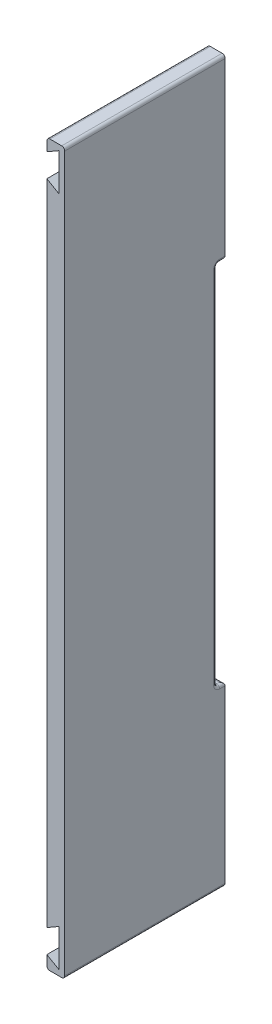
ISO-10303-21;
HEADER;
FILE_DESCRIPTION(('STEP AP214'),'2;1');
FILE_NAME('part.step','',(''),(''),'','','');
FILE_SCHEMA(('AUTOMOTIVE_DESIGN { 1 0 10303 214 1 1 1 1 }'));
ENDSEC;
DATA;
#1=APPLICATION_CONTEXT('core data for automotive mechanical design processes');
#2=APPLICATION_PROTOCOL_DEFINITION('international standard','automotive_design',2000,#1);
#3=PRODUCT_CONTEXT('',#1,'mechanical');
#4=PRODUCT('Part','Part','',(#3));
#5=PRODUCT_RELATED_PRODUCT_CATEGORY('part','',(#4));
#6=PRODUCT_DEFINITION_FORMATION('','',#4);
#7=PRODUCT_DEFINITION_CONTEXT('part definition',#1,'design');
#8=PRODUCT_DEFINITION('design','',#6,#7);
#9=PRODUCT_DEFINITION_SHAPE('','',#8);
#10=(LENGTH_UNIT() NAMED_UNIT(*) SI_UNIT(.MILLI.,.METRE.));
#11=(NAMED_UNIT(*) PLANE_ANGLE_UNIT() SI_UNIT($,.RADIAN.));
#12=(NAMED_UNIT(*) SI_UNIT($,.STERADIAN.) SOLID_ANGLE_UNIT());
#13=UNCERTAINTY_MEASURE_WITH_UNIT(LENGTH_MEASURE(1.E-05),#10,'distance_accuracy_value','');
#14=(GEOMETRIC_REPRESENTATION_CONTEXT(3) GLOBAL_UNCERTAINTY_ASSIGNED_CONTEXT((#13)) GLOBAL_UNIT_ASSIGNED_CONTEXT((#10,
#11,#12)) REPRESENTATION_CONTEXT('',''));
#15=CARTESIAN_POINT('',(0.,0.,0.));
#16=DIRECTION('',(0.,0.,1.));
#17=DIRECTION('',(1.,0.,0.));
#18=AXIS2_PLACEMENT_3D('',#15,#16,#17);
#19=CARTESIAN_POINT('',(0.,-226.14,53.));
#20=DIRECTION('',(1.,0.,0.));
#21=DIRECTION('',(0.,1.,0.));
#22=AXIS2_PLACEMENT_3D('',#19,#20,#21);
#23=PLANE('',#22);
#24=DIRECTION('',(0.,-1.,0.));
#25=VECTOR('',#24,1.);
#26=CARTESIAN_POINT('',(0.,-226.14,0.));
#27=LINE('',#26,#25);
#28=CARTESIAN_POINT('',(0.,-11.86,0.));
#29=VERTEX_POINT('',#28);
#30=CARTESIAN_POINT('',(6.1431709465119E-13,-57.5000000000001,0.));
#31=VERTEX_POINT('',#30);
#32=EDGE_CURVE('E282',#29,#31,#27,.T.);
#33=ORIENTED_EDGE('',*,*,#32,.T.);
#34=DIRECTION('',(0.,0.,1.));
#35=VECTOR('',#34,1.);
#36=CARTESIAN_POINT('',(6.14308950930287E-13,-57.5,2.8));
#37=LINE('',#36,#35);
#38=CARTESIAN_POINT('',(6.14317094651191E-13,-57.5,1.79999999999999));
#39=VERTEX_POINT('',#38);
#40=EDGE_CURVE('E349',#31,#39,#37,.T.);
#41=ORIENTED_EDGE('',*,*,#40,.T.);
#42=CARTESIAN_POINT('',(6.07153216591882E-13,-59.5,1.79999999999999));
#43=DIRECTION('',(1.,0.,0.));
#44=DIRECTION('',(0.,1.,0.));
#45=AXIS2_PLACEMENT_3D('',#42,#43,#44);
#46=CIRCLE('',#45,2.);
#47=CARTESIAN_POINT('',(6.07038405593292E-13,-59.5,3.79999999999999));
#48=VERTEX_POINT('',#47);
#49=EDGE_CURVE('E346',#48,#39,#46,.F.);
#50=ORIENTED_EDGE('',*,*,#49,.F.);
#51=DIRECTION('',(0.,-1.,0.));
#52=VECTOR('',#51,1.);
#53=CARTESIAN_POINT('',(1.70436581514721E-13,-179.5,3.79999999999998));
#54=LINE('',#53,#52);
#55=CARTESIAN_POINT('',(1.73956406648338E-13,-178.5,3.79999999999998));
#56=VERTEX_POINT('',#55);
#57=EDGE_CURVE('E342',#48,#56,#54,.T.);
#58=ORIENTED_EDGE('',*,*,#57,.T.);
#59=CARTESIAN_POINT('',(1.74122868901172E-13,-178.5,1.79999999999998));
#60=DIRECTION('',(1.,0.,0.));
#61=DIRECTION('',(0.,1.,0.));
#62=AXIS2_PLACEMENT_3D('',#59,#60,#61);
#63=CIRCLE('',#62,2.);
#64=CARTESIAN_POINT('',(1.66677717590439E-13,-180.5,1.79999999999998));
#65=VERTEX_POINT('',#64);
#66=EDGE_CURVE('E339',#65,#56,#63,.F.);
#67=ORIENTED_EDGE('',*,*,#66,.F.);
#68=DIRECTION('',(0.,0.,-1.));
#69=VECTOR('',#68,1.);
#70=CARTESIAN_POINT('',(1.66750294128271E-13,-180.5,0.));
#71=LINE('',#70,#69);
#72=CARTESIAN_POINT('',(1.66677717590439E-13,-180.5,0.));
#73=VERTEX_POINT('',#72);
#74=EDGE_CURVE('E344',#65,#73,#71,.T.);
#75=ORIENTED_EDGE('',*,*,#74,.T.);
#76=CARTESIAN_POINT('',(0.,-226.14,0.));
#77=VERTEX_POINT('',#76);
#78=EDGE_CURVE('E281',#73,#77,#27,.T.);
#79=ORIENTED_EDGE('',*,*,#78,.T.);
#80=DIRECTION('',(0.,0.,-1.));
#81=VECTOR('',#80,1.);
#82=CARTESIAN_POINT('',(0.,-226.14,53.));
#83=LINE('',#82,#81);
#84=CARTESIAN_POINT('',(0.,-226.14,53.));
#85=VERTEX_POINT('',#84);
#86=EDGE_CURVE('E308',#85,#77,#83,.T.);
#87=ORIENTED_EDGE('',*,*,#86,.F.);
#88=DIRECTION('',(0.,-1.,0.));
#89=VECTOR('',#88,1.);
#90=CARTESIAN_POINT('',(0.,-11.86,53.));
#91=LINE('',#90,#89);
#92=CARTESIAN_POINT('',(0.,-11.86,53.));
#93=VERTEX_POINT('',#92);
#94=EDGE_CURVE('E253',#93,#85,#91,.T.);
#95=ORIENTED_EDGE('',*,*,#94,.F.);
#96=DIRECTION('',(0.,0.,-1.));
#97=VECTOR('',#96,1.);
#98=CARTESIAN_POINT('',(0.,-11.86,53.));
#99=LINE('',#98,#97);
#100=EDGE_CURVE('E311',#93,#29,#99,.T.);
#101=ORIENTED_EDGE('',*,*,#100,.T.);
#102=EDGE_LOOP('',(#33,#41,#50,#58,#67,#75,#79,#87,#95,#101));
#103=FACE_BOUND('',#102,.T.);
#104=ADVANCED_FACE('F37',(#103),#23,.F.);
#105=CARTESIAN_POINT('',(5.9,-8.66559145378895,53.));
#106=DIRECTION('',(-1.,0.,0.));
#107=DIRECTION('',(0.,0.,1.));
#108=AXIS2_PLACEMENT_3D('',#105,#106,#107);
#109=PLANE('',#108);
#110=DIRECTION('',(0.,1.,0.));
#111=VECTOR('',#110,1.);
#112=CARTESIAN_POINT('',(5.9,-229.334408546211,53.));
#113=LINE('',#112,#111);
#114=CARTESIAN_POINT('',(5.9,-237.,53.));
#115=VERTEX_POINT('',#114);
#116=CARTESIAN_POINT('',(5.9,-1.,53.));
#117=VERTEX_POINT('',#116);
#118=EDGE_CURVE('E266',#115,#117,#113,.T.);
#119=ORIENTED_EDGE('',*,*,#118,.F.);
#120=DIRECTION('',(0.,0.,-1.));
#121=VECTOR('',#120,1.);
#122=CARTESIAN_POINT('',(5.9,-237.,53.));
#123=LINE('',#122,#121);
#124=CARTESIAN_POINT('',(5.9,-237.,0.));
#125=VERTEX_POINT('',#124);
#126=EDGE_CURVE('E438',#115,#125,#123,.T.);
#127=ORIENTED_EDGE('',*,*,#126,.T.);
#128=DIRECTION('',(0.,1.,0.));
#129=VECTOR('',#128,1.);
#130=CARTESIAN_POINT('',(5.9,-8.66559145378895,0.));
#131=LINE('',#130,#129);
#132=CARTESIAN_POINT('',(5.9,-180.5,0.));
#133=VERTEX_POINT('',#132);
#134=EDGE_CURVE('E298',#125,#133,#131,.T.);
#135=ORIENTED_EDGE('',*,*,#134,.T.);
#136=DIRECTION('',(0.,0.,-1.));
#137=VECTOR('',#136,1.);
#138=CARTESIAN_POINT('',(5.9,-180.5,2.79999999999998));
#139=LINE('',#138,#137);
#140=CARTESIAN_POINT('',(5.9,-180.5,1.79999999999998));
#141=VERTEX_POINT('',#140);
#142=EDGE_CURVE('E334',#133,#141,#139,.F.);
#143=ORIENTED_EDGE('',*,*,#142,.T.);
#144=CARTESIAN_POINT('',(5.9,-178.5,1.79999999999998));
#145=DIRECTION('',(-1.,0.,0.));
#146=DIRECTION('',(0.,0.,1.));
#147=AXIS2_PLACEMENT_3D('',#144,#145,#146);
#148=CIRCLE('',#147,2.);
#149=CARTESIAN_POINT('',(5.9,-178.5,3.79999999999998));
#150=VERTEX_POINT('',#149);
#151=EDGE_CURVE('E331',#150,#141,#148,.F.);
#152=ORIENTED_EDGE('',*,*,#151,.F.);
#153=DIRECTION('',(0.,-1.,0.));
#154=VECTOR('',#153,1.);
#155=CARTESIAN_POINT('',(5.9,-58.5,3.79999999999999));
#156=LINE('',#155,#154);
#157=CARTESIAN_POINT('',(5.9,-59.5,3.79999999999999));
#158=VERTEX_POINT('',#157);
#159=EDGE_CURVE('E329',#150,#158,#156,.F.);
#160=ORIENTED_EDGE('',*,*,#159,.T.);
#161=CARTESIAN_POINT('',(5.9,-59.5,1.79999999999999));
#162=DIRECTION('',(-1.,0.,0.));
#163=DIRECTION('',(0.,0.,1.));
#164=AXIS2_PLACEMENT_3D('',#161,#162,#163);
#165=CIRCLE('',#164,2.);
#166=CARTESIAN_POINT('',(5.9,-57.5,1.79999999999999));
#167=VERTEX_POINT('',#166);
#168=EDGE_CURVE('E326',#167,#158,#165,.F.);
#169=ORIENTED_EDGE('',*,*,#168,.F.);
#170=DIRECTION('',(0.,0.,1.));
#171=VECTOR('',#170,1.);
#172=CARTESIAN_POINT('',(5.9,-57.5,0.));
#173=LINE('',#172,#171);
#174=CARTESIAN_POINT('',(5.9,-57.5,0.));
#175=VERTEX_POINT('',#174);
#176=EDGE_CURVE('E336',#167,#175,#173,.F.);
#177=ORIENTED_EDGE('',*,*,#176,.T.);
#178=CARTESIAN_POINT('',(5.9,-1.,0.));
#179=VERTEX_POINT('',#178);
#180=EDGE_CURVE('E297',#175,#179,#131,.T.);
#181=ORIENTED_EDGE('',*,*,#180,.T.);
#182=DIRECTION('',(0.,0.,-1.));
#183=VECTOR('',#182,1.);
#184=CARTESIAN_POINT('',(5.9,-1.,53.));
#185=LINE('',#184,#183);
#186=EDGE_CURVE('E436',#179,#117,#185,.F.);
#187=ORIENTED_EDGE('',*,*,#186,.T.);
#188=EDGE_LOOP('',(#119,#127,#135,#143,#152,#160,#169,#177,#181,#187));
#189=FACE_BOUND('',#188,.T.);
#190=ADVANCED_FACE('F454',(#189),#109,.F.);
#191=CARTESIAN_POINT('',(0.,0.,0.));
#192=DIRECTION('',(0.,0.,1.));
#193=DIRECTION('',(1.,0.,0.));
#194=AXIS2_PLACEMENT_3D('',#191,#192,#193);
#195=PLANE('',#194);
#196=DIRECTION('',(-1.,0.,0.));
#197=VECTOR('',#196,1.);
#198=CARTESIAN_POINT('',(5.9,0.,0.));
#199=LINE('',#198,#197);
#200=CARTESIAN_POINT('',(4.9,0.,0.));
#201=VERTEX_POINT('',#200);
#202=CARTESIAN_POINT('',(1.,0.,0.));
#203=VERTEX_POINT('',#202);
#204=EDGE_CURVE('E270',#201,#203,#199,.T.);
#205=ORIENTED_EDGE('',*,*,#204,.F.);
#206=CARTESIAN_POINT('',(4.9,-1.,0.));
#207=DIRECTION('',(0.,0.,1.));
#208=DIRECTION('',(1.,0.,0.));
#209=AXIS2_PLACEMENT_3D('',#206,#207,#208);
#210=CIRCLE('',#209,1.);
#211=EDGE_CURVE('E45',#201,#179,#210,.F.);
#212=ORIENTED_EDGE('',*,*,#211,.T.);
#213=ORIENTED_EDGE('',*,*,#180,.F.);
#214=DIRECTION('',(1.,0.,0.));
#215=VECTOR('',#214,1.);
#216=CARTESIAN_POINT('',(-2.08166817117217E-13,-57.5,0.));
#217=LINE('',#216,#215);
#218=EDGE_CURVE('E360',#175,#31,#217,.F.);
#219=ORIENTED_EDGE('',*,*,#218,.T.);
#220=ORIENTED_EDGE('',*,*,#32,.F.);
#221=DIRECTION('',(-0.86602540378444,0.499999999999998,0.));
#222=VECTOR('',#221,1.);
#223=CARTESIAN_POINT('',(0.,-11.86,0.));
#224=LINE('',#223,#222);
#225=CARTESIAN_POINT('',(4.00969761952194,-14.175,0.));
#226=VERTEX_POINT('',#225);
#227=EDGE_CURVE('E278',#226,#29,#224,.T.);
#228=ORIENTED_EDGE('',*,*,#227,.F.);
#229=DIRECTION('',(0.,-1.,0.));
#230=VECTOR('',#229,1.);
#231=CARTESIAN_POINT('',(4.00969761952194,-1.82499999999998,0.));
#232=LINE('',#231,#230);
#233=CARTESIAN_POINT('',(4.00969761952194,-1.82499999999998,0.));
#234=VERTEX_POINT('',#233);
#235=EDGE_CURVE('E276',#234,#226,#232,.T.);
#236=ORIENTED_EDGE('',*,*,#235,.F.);
#237=DIRECTION('',(0.866025403784436,0.500000000000004,0.));
#238=VECTOR('',#237,1.);
#239=CARTESIAN_POINT('',(0.,-4.14,0.));
#240=LINE('',#239,#238);
#241=CARTESIAN_POINT('',(0.,-4.14,0.));
#242=VERTEX_POINT('',#241);
#243=EDGE_CURVE('E274',#242,#234,#240,.T.);
#244=ORIENTED_EDGE('',*,*,#243,.F.);
#245=DIRECTION('',(0.,-1.,0.));
#246=VECTOR('',#245,1.);
#247=CARTESIAN_POINT('',(0.,0.,0.));
#248=LINE('',#247,#246);
#249=CARTESIAN_POINT('',(0.,-1.,0.));
#250=VERTEX_POINT('',#249);
#251=EDGE_CURVE('E237',#250,#242,#248,.T.);
#252=ORIENTED_EDGE('',*,*,#251,.F.);
#253=CARTESIAN_POINT('',(1.,-1.,0.));
#254=DIRECTION('',(0.,0.,1.));
#255=DIRECTION('',(1.,0.,0.));
#256=AXIS2_PLACEMENT_3D('',#253,#254,#255);
#257=CIRCLE('',#256,1.);
#258=EDGE_CURVE('E52',#250,#203,#257,.F.);
#259=ORIENTED_EDGE('',*,*,#258,.T.);
#260=EDGE_LOOP('',(#205,#212,#213,#219,#220,#228,#236,#244,#252,#259));
#261=FACE_BOUND('',#260,.T.);
#262=ADVANCED_FACE('F448',(#261),#195,.F.);
#263=DIRECTION('',(1.,0.,0.));
#264=VECTOR('',#263,1.);
#265=CARTESIAN_POINT('',(5.9,-238.,0.));
#266=LINE('',#265,#264);
#267=CARTESIAN_POINT('',(0.999999999999996,-238.,0.));
#268=VERTEX_POINT('',#267);
#269=CARTESIAN_POINT('',(4.9,-238.,0.));
#270=VERTEX_POINT('',#269);
#271=EDGE_CURVE('E294',#268,#270,#266,.T.);
#272=ORIENTED_EDGE('',*,*,#271,.F.);
#273=CARTESIAN_POINT('',(1.,-237.,0.));
#274=DIRECTION('',(0.,0.,1.));
#275=DIRECTION('',(1.,0.,0.));
#276=AXIS2_PLACEMENT_3D('',#273,#274,#275);
#277=CIRCLE('',#276,1.);
#278=CARTESIAN_POINT('',(0.,-237.,0.));
#279=VERTEX_POINT('',#278);
#280=EDGE_CURVE('E425',#268,#279,#277,.F.);
#281=ORIENTED_EDGE('',*,*,#280,.T.);
#282=DIRECTION('',(0.,-1.,0.));
#283=VECTOR('',#282,1.);
#284=CARTESIAN_POINT('',(0.,-238.,0.));
#285=LINE('',#284,#283);
#286=CARTESIAN_POINT('',(0.,-233.86,0.));
#287=VERTEX_POINT('',#286);
#288=EDGE_CURVE('E291',#287,#279,#285,.T.);
#289=ORIENTED_EDGE('',*,*,#288,.F.);
#290=DIRECTION('',(-0.866025403784434,0.500000000000008,0.));
#291=VECTOR('',#290,1.);
#292=CARTESIAN_POINT('',(0.,-233.86,0.));
#293=LINE('',#292,#291);
#294=CARTESIAN_POINT('',(4.00969761952194,-236.175,0.));
#295=VERTEX_POINT('',#294);
#296=EDGE_CURVE('E289',#295,#287,#293,.T.);
#297=ORIENTED_EDGE('',*,*,#296,.F.);
#298=DIRECTION('',(0.,-1.,0.));
#299=VECTOR('',#298,1.);
#300=CARTESIAN_POINT('',(4.00969761952194,-236.175,0.));
#301=LINE('',#300,#299);
#302=CARTESIAN_POINT('',(4.00969761952194,-223.825,0.));
#303=VERTEX_POINT('',#302);
#304=EDGE_CURVE('E287',#303,#295,#301,.T.);
#305=ORIENTED_EDGE('',*,*,#304,.F.);
#306=DIRECTION('',(0.866025403784439,0.499999999999998,0.));
#307=VECTOR('',#306,1.);
#308=CARTESIAN_POINT('',(0.,-226.14,0.));
#309=LINE('',#308,#307);
#310=EDGE_CURVE('E285',#77,#303,#309,.T.);
#311=ORIENTED_EDGE('',*,*,#310,.F.);
#312=ORIENTED_EDGE('',*,*,#78,.F.);
#313=DIRECTION('',(-1.,0.,0.));
#314=VECTOR('',#313,1.);
#315=CARTESIAN_POINT('',(5.9,-180.5,0.));
#316=LINE('',#315,#314);
#317=EDGE_CURVE('E371',#73,#133,#316,.F.);
#318=ORIENTED_EDGE('',*,*,#317,.T.);
#319=ORIENTED_EDGE('',*,*,#134,.F.);
#320=CARTESIAN_POINT('',(4.9,-237.,0.));
#321=DIRECTION('',(0.,0.,1.));
#322=DIRECTION('',(1.,0.,0.));
#323=AXIS2_PLACEMENT_3D('',#320,#321,#322);
#324=CIRCLE('',#323,1.);
#325=EDGE_CURVE('E423',#125,#270,#324,.F.);
#326=ORIENTED_EDGE('',*,*,#325,.T.);
#327=EDGE_LOOP('',(#272,#281,#289,#297,#305,#311,#312,#318,#319,#326));
#328=FACE_BOUND('',#327,.T.);
#329=ADVANCED_FACE('F504',(#328),#195,.F.);
#330=CARTESIAN_POINT('',(5.9,0.,53.));
#331=DIRECTION('',(0.,-1.,0.));
#332=DIRECTION('',(1.,0.,0.));
#333=AXIS2_PLACEMENT_3D('',#330,#331,#332);
#334=PLANE('',#333);
#335=DIRECTION('',(-1.,0.,0.));
#336=VECTOR('',#335,1.);
#337=CARTESIAN_POINT('',(5.9,0.,53.));
#338=LINE('',#337,#336);
#339=CARTESIAN_POINT('',(4.9,0.,53.));
#340=VERTEX_POINT('',#339);
#341=CARTESIAN_POINT('',(1.,0.,53.));
#342=VERTEX_POINT('',#341);
#343=EDGE_CURVE('E232',#340,#342,#338,.T.);
#344=ORIENTED_EDGE('',*,*,#343,.F.);
#345=DIRECTION('',(0.,0.,-1.));
#346=VECTOR('',#345,1.);
#347=CARTESIAN_POINT('',(4.9,0.,53.));
#348=LINE('',#347,#346);
#349=EDGE_CURVE('E443',#340,#201,#348,.T.);
#350=ORIENTED_EDGE('',*,*,#349,.T.);
#351=ORIENTED_EDGE('',*,*,#204,.T.);
#352=DIRECTION('',(0.,0.,-1.));
#353=VECTOR('',#352,1.);
#354=CARTESIAN_POINT('',(1.,0.,53.));
#355=LINE('',#354,#353);
#356=EDGE_CURVE('E441',#203,#342,#355,.F.);
#357=ORIENTED_EDGE('',*,*,#356,.T.);
#358=EDGE_LOOP('',(#344,#350,#351,#357));
#359=FACE_BOUND('',#358,.T.);
#360=ADVANCED_FACE('F460',(#359),#334,.F.);
#361=CARTESIAN_POINT('',(0.,0.,53.));
#362=DIRECTION('',(1.,0.,0.));
#363=DIRECTION('',(0.,1.,0.));
#364=AXIS2_PLACEMENT_3D('',#361,#362,#363);
#365=PLANE('',#364);
#366=DIRECTION('',(0.,-1.,0.));
#367=VECTOR('',#366,1.);
#368=CARTESIAN_POINT('',(0.,0.,53.));
#369=LINE('',#368,#367);
#370=CARTESIAN_POINT('',(0.,-1.,53.));
#371=VERTEX_POINT('',#370);
#372=CARTESIAN_POINT('',(0.,-4.14,53.));
#373=VERTEX_POINT('',#372);
#374=EDGE_CURVE('E221',#371,#373,#369,.T.);
#375=ORIENTED_EDGE('',*,*,#374,.F.);
#376=DIRECTION('',(0.,0.,-1.));
#377=VECTOR('',#376,1.);
#378=CARTESIAN_POINT('',(0.,-1.,53.));
#379=LINE('',#378,#377);
#380=EDGE_CURVE('E11',#371,#250,#379,.T.);
#381=ORIENTED_EDGE('',*,*,#380,.T.);
#382=ORIENTED_EDGE('',*,*,#251,.T.);
#383=DIRECTION('',(0.,0.,-1.));
#384=VECTOR('',#383,1.);
#385=CARTESIAN_POINT('',(0.,-4.14,53.));
#386=LINE('',#385,#384);
#387=EDGE_CURVE('E235',#373,#242,#386,.T.);
#388=ORIENTED_EDGE('',*,*,#387,.F.);
#389=EDGE_LOOP('',(#375,#381,#382,#388));
#390=FACE_BOUND('',#389,.T.);
#391=ADVANCED_FACE('F236',(#390),#365,.F.);
#392=CARTESIAN_POINT('',(0.,-4.14,53.));
#393=DIRECTION('',(-0.500000000000004,0.866025403784436,0.));
#394=DIRECTION('',(-0.866025403784436,-0.500000000000004,0.));
#395=AXIS2_PLACEMENT_3D('',#392,#393,#394);
#396=PLANE('',#395);
#397=ORIENTED_EDGE('',*,*,#243,.T.);
#398=DIRECTION('',(0.,0.,-1.));
#399=VECTOR('',#398,1.);
#400=CARTESIAN_POINT('',(4.00969761952194,-1.82499999999998,53.));
#401=LINE('',#400,#399);
#402=CARTESIAN_POINT('',(4.00969761952194,-1.82499999999998,53.));
#403=VERTEX_POINT('',#402);
#404=EDGE_CURVE('E241',#403,#234,#401,.T.);
#405=ORIENTED_EDGE('',*,*,#404,.F.);
#406=DIRECTION('',(0.866025403784436,0.500000000000004,0.));
#407=VECTOR('',#406,1.);
#408=CARTESIAN_POINT('',(0.,-4.14,53.));
#409=LINE('',#408,#407);
#410=EDGE_CURVE('E226',#373,#403,#409,.T.);
#411=ORIENTED_EDGE('',*,*,#410,.F.);
#412=ORIENTED_EDGE('',*,*,#387,.T.);
#413=EDGE_LOOP('',(#397,#405,#411,#412));
#414=FACE_BOUND('',#413,.T.);
#415=ADVANCED_FACE('F243',(#414),#396,.F.);
#416=CARTESIAN_POINT('',(4.00969761952194,-1.82499999999998,53.));
#417=DIRECTION('',(1.,0.,0.));
#418=DIRECTION('',(0.,1.,0.));
#419=AXIS2_PLACEMENT_3D('',#416,#417,#418);
#420=PLANE('',#419);
#421=ORIENTED_EDGE('',*,*,#235,.T.);
#422=DIRECTION('',(0.,0.,-1.));
#423=VECTOR('',#422,1.);
#424=CARTESIAN_POINT('',(4.00969761952194,-14.175,53.));
#425=LINE('',#424,#423);
#426=CARTESIAN_POINT('',(4.00969761952194,-14.175,53.));
#427=VERTEX_POINT('',#426);
#428=EDGE_CURVE('E314',#427,#226,#425,.T.);
#429=ORIENTED_EDGE('',*,*,#428,.F.);
#430=DIRECTION('',(0.,-1.,0.));
#431=VECTOR('',#430,1.);
#432=CARTESIAN_POINT('',(4.00969761952194,-1.82499999999998,53.));
#433=LINE('',#432,#431);
#434=EDGE_CURVE('E246',#403,#427,#433,.T.);
#435=ORIENTED_EDGE('',*,*,#434,.F.);
#436=ORIENTED_EDGE('',*,*,#404,.T.);
#437=EDGE_LOOP('',(#421,#429,#435,#436));
#438=FACE_BOUND('',#437,.T.);
#439=ADVANCED_FACE('F464',(#438),#420,.F.);
#440=CARTESIAN_POINT('',(0.,-11.86,53.));
#441=DIRECTION('',(-0.499999999999998,-0.86602540378444,0.));
#442=DIRECTION('',(0.86602540378444,-0.499999999999998,0.));
#443=AXIS2_PLACEMENT_3D('',#440,#441,#442);
#444=PLANE('',#443);
#445=ORIENTED_EDGE('',*,*,#227,.T.);
#446=ORIENTED_EDGE('',*,*,#100,.F.);
#447=DIRECTION('',(-0.86602540378444,0.499999999999998,0.));
#448=VECTOR('',#447,1.);
#449=CARTESIAN_POINT('',(0.,-11.86,53.));
#450=LINE('',#449,#448);
#451=EDGE_CURVE('E248',#427,#93,#450,.T.);
#452=ORIENTED_EDGE('',*,*,#451,.F.);
#453=ORIENTED_EDGE('',*,*,#428,.T.);
#454=EDGE_LOOP('',(#445,#446,#452,#453));
#455=FACE_BOUND('',#454,.T.);
#456=ADVANCED_FACE('F471',(#455),#444,.F.);
#457=CARTESIAN_POINT('',(0.,-226.14,53.));
#458=DIRECTION('',(-0.499999999999999,0.86602540378444,0.));
#459=DIRECTION('',(-0.86602540378444,-0.499999999999999,0.));
#460=AXIS2_PLACEMENT_3D('',#457,#458,#459);
#461=PLANE('',#460);
#462=ORIENTED_EDGE('',*,*,#310,.T.);
#463=DIRECTION('',(0.,0.,-1.));
#464=VECTOR('',#463,1.);
#465=CARTESIAN_POINT('',(4.00969761952194,-223.825,53.));
#466=LINE('',#465,#464);
#467=CARTESIAN_POINT('',(4.00969761952194,-223.825,53.));
#468=VERTEX_POINT('',#467);
#469=EDGE_CURVE('E305',#468,#303,#466,.T.);
#470=ORIENTED_EDGE('',*,*,#469,.F.);
#471=DIRECTION('',(0.866025403784439,0.499999999999998,0.));
#472=VECTOR('',#471,1.);
#473=CARTESIAN_POINT('',(0.,-226.14,53.));
#474=LINE('',#473,#472);
#475=EDGE_CURVE('E255',#85,#468,#474,.T.);
#476=ORIENTED_EDGE('',*,*,#475,.F.);
#477=ORIENTED_EDGE('',*,*,#86,.T.);
#478=EDGE_LOOP('',(#462,#470,#476,#477));
#479=FACE_BOUND('',#478,.T.);
#480=ADVANCED_FACE('F478',(#479),#461,.F.);
#481=CARTESIAN_POINT('',(4.00969761952194,-236.175,53.));
#482=DIRECTION('',(1.,0.,0.));
#483=DIRECTION('',(0.,1.,0.));
#484=AXIS2_PLACEMENT_3D('',#481,#482,#483);
#485=PLANE('',#484);
#486=ORIENTED_EDGE('',*,*,#304,.T.);
#487=DIRECTION('',(0.,0.,-1.));
#488=VECTOR('',#487,1.);
#489=CARTESIAN_POINT('',(4.00969761952194,-236.175,53.));
#490=LINE('',#489,#488);
#491=CARTESIAN_POINT('',(4.00969761952194,-236.175,53.));
#492=VERTEX_POINT('',#491);
#493=EDGE_CURVE('E302',#492,#295,#490,.T.);
#494=ORIENTED_EDGE('',*,*,#493,.F.);
#495=DIRECTION('',(0.,-1.,0.));
#496=VECTOR('',#495,1.);
#497=CARTESIAN_POINT('',(4.00969761952194,-236.175,53.));
#498=LINE('',#497,#496);
#499=EDGE_CURVE('E257',#468,#492,#498,.T.);
#500=ORIENTED_EDGE('',*,*,#499,.F.);
#501=ORIENTED_EDGE('',*,*,#469,.T.);
#502=EDGE_LOOP('',(#486,#494,#500,#501));
#503=FACE_BOUND('',#502,.T.);
#504=ADVANCED_FACE('F484',(#503),#485,.F.);
#505=CARTESIAN_POINT('',(0.,-233.86,53.));
#506=DIRECTION('',(-0.500000000000008,-0.866025403784434,0.));
#507=DIRECTION('',(0.866025403784434,-0.500000000000008,0.));
#508=AXIS2_PLACEMENT_3D('',#505,#506,#507);
#509=PLANE('',#508);
#510=ORIENTED_EDGE('',*,*,#296,.T.);
#511=DIRECTION('',(0.,0.,-1.));
#512=VECTOR('',#511,1.);
#513=CARTESIAN_POINT('',(0.,-233.86,53.));
#514=LINE('',#513,#512);
#515=CARTESIAN_POINT('',(0.,-233.86,53.));
#516=VERTEX_POINT('',#515);
#517=EDGE_CURVE('E269',#516,#287,#514,.T.);
#518=ORIENTED_EDGE('',*,*,#517,.F.);
#519=DIRECTION('',(-0.866025403784434,0.500000000000008,0.));
#520=VECTOR('',#519,1.);
#521=CARTESIAN_POINT('',(0.,-233.86,53.));
#522=LINE('',#521,#520);
#523=EDGE_CURVE('E259',#492,#516,#522,.T.);
#524=ORIENTED_EDGE('',*,*,#523,.F.);
#525=ORIENTED_EDGE('',*,*,#493,.T.);
#526=EDGE_LOOP('',(#510,#518,#524,#525));
#527=FACE_BOUND('',#526,.T.);
#528=ADVANCED_FACE('F488',(#527),#509,.F.);
#529=CARTESIAN_POINT('',(0.,-238.,53.));
#530=DIRECTION('',(1.,0.,0.));
#531=DIRECTION('',(0.,1.,0.));
#532=AXIS2_PLACEMENT_3D('',#529,#530,#531);
#533=PLANE('',#532);
#534=ORIENTED_EDGE('',*,*,#288,.T.);
#535=DIRECTION('',(0.,0.,-1.));
#536=VECTOR('',#535,1.);
#537=CARTESIAN_POINT('',(0.,-237.,53.));
#538=LINE('',#537,#536);
#539=CARTESIAN_POINT('',(0.,-237.,53.));
#540=VERTEX_POINT('',#539);
#541=EDGE_CURVE('E427',#279,#540,#538,.F.);
#542=ORIENTED_EDGE('',*,*,#541,.T.);
#543=DIRECTION('',(0.,-1.,0.));
#544=VECTOR('',#543,1.);
#545=CARTESIAN_POINT('',(0.,-238.,53.));
#546=LINE('',#545,#544);
#547=EDGE_CURVE('E261',#516,#540,#546,.T.);
#548=ORIENTED_EDGE('',*,*,#547,.F.);
#549=ORIENTED_EDGE('',*,*,#517,.T.);
#550=EDGE_LOOP('',(#534,#542,#548,#549));
#551=FACE_BOUND('',#550,.T.);
#552=ADVANCED_FACE('F492',(#551),#533,.F.);
#553=CARTESIAN_POINT('',(5.9,-238.,53.));
#554=DIRECTION('',(0.,1.,0.));
#555=DIRECTION('',(-1.,0.,0.));
#556=AXIS2_PLACEMENT_3D('',#553,#554,#555);
#557=PLANE('',#556);
#558=DIRECTION('',(1.,0.,0.));
#559=VECTOR('',#558,1.);
#560=CARTESIAN_POINT('',(5.9,-238.,53.));
#561=LINE('',#560,#559);
#562=CARTESIAN_POINT('',(0.999999999999996,-238.,53.));
#563=VERTEX_POINT('',#562);
#564=CARTESIAN_POINT('',(4.9,-238.,53.));
#565=VERTEX_POINT('',#564);
#566=EDGE_CURVE('E263',#563,#565,#561,.T.);
#567=ORIENTED_EDGE('',*,*,#566,.F.);
#568=DIRECTION('',(0.,0.,-1.));
#569=VECTOR('',#568,1.);
#570=CARTESIAN_POINT('',(0.999999999999996,-238.,53.));
#571=LINE('',#570,#569);
#572=EDGE_CURVE('E420',#563,#268,#571,.T.);
#573=ORIENTED_EDGE('',*,*,#572,.T.);
#574=ORIENTED_EDGE('',*,*,#271,.T.);
#575=DIRECTION('',(0.,0.,-1.));
#576=VECTOR('',#575,1.);
#577=CARTESIAN_POINT('',(4.9,-238.,53.));
#578=LINE('',#577,#576);
#579=EDGE_CURVE('E374',#270,#565,#578,.F.);
#580=ORIENTED_EDGE('',*,*,#579,.T.);
#581=EDGE_LOOP('',(#567,#573,#574,#580));
#582=FACE_BOUND('',#581,.T.);
#583=ADVANCED_FACE('F501',(#582),#557,.F.);
#584=CARTESIAN_POINT('',(0.,0.,53.));
#585=DIRECTION('',(0.,0.,1.));
#586=DIRECTION('',(1.,0.,0.));
#587=AXIS2_PLACEMENT_3D('',#584,#585,#586);
#588=PLANE('',#587);
#589=ORIENTED_EDGE('',*,*,#547,.T.);
#590=CARTESIAN_POINT('',(1.,-237.,53.));
#591=DIRECTION('',(0.,0.,1.));
#592=DIRECTION('',(1.,0.,0.));
#593=AXIS2_PLACEMENT_3D('',#590,#591,#592);
#594=CIRCLE('',#593,1.);
#595=EDGE_CURVE('E434',#540,#563,#594,.T.);
#596=ORIENTED_EDGE('',*,*,#595,.T.);
#597=ORIENTED_EDGE('',*,*,#566,.T.);
#598=CARTESIAN_POINT('',(4.9,-237.,53.));
#599=DIRECTION('',(0.,0.,1.));
#600=DIRECTION('',(1.,0.,0.));
#601=AXIS2_PLACEMENT_3D('',#598,#599,#600);
#602=CIRCLE('',#601,1.);
#603=EDGE_CURVE('E432',#565,#115,#602,.T.);
#604=ORIENTED_EDGE('',*,*,#603,.T.);
#605=ORIENTED_EDGE('',*,*,#118,.T.);
#606=CARTESIAN_POINT('',(4.9,-1.,53.));
#607=DIRECTION('',(0.,0.,1.));
#608=DIRECTION('',(1.,0.,0.));
#609=AXIS2_PLACEMENT_3D('',#606,#607,#608);
#610=CIRCLE('',#609,1.);
#611=EDGE_CURVE('E430',#117,#340,#610,.T.);
#612=ORIENTED_EDGE('',*,*,#611,.T.);
#613=ORIENTED_EDGE('',*,*,#343,.T.);
#614=CARTESIAN_POINT('',(1.,-1.,53.));
#615=DIRECTION('',(0.,0.,1.));
#616=DIRECTION('',(1.,0.,0.));
#617=AXIS2_PLACEMENT_3D('',#614,#615,#616);
#618=CIRCLE('',#617,1.);
#619=EDGE_CURVE('E230',#342,#371,#618,.T.);
#620=ORIENTED_EDGE('',*,*,#619,.T.);
#621=ORIENTED_EDGE('',*,*,#374,.T.);
#622=ORIENTED_EDGE('',*,*,#410,.T.);
#623=ORIENTED_EDGE('',*,*,#434,.T.);
#624=ORIENTED_EDGE('',*,*,#451,.T.);
#625=ORIENTED_EDGE('',*,*,#94,.T.);
#626=ORIENTED_EDGE('',*,*,#475,.T.);
#627=ORIENTED_EDGE('',*,*,#499,.T.);
#628=ORIENTED_EDGE('',*,*,#523,.T.);
#629=EDGE_LOOP('',(#589,#596,#597,#604,#605,#612,#613,#620,#621,#622,#623,#624,#625,#626,#627,#628));
#630=FACE_BOUND('',#629,.T.);
#631=ADVANCED_FACE('F224',(#630),#588,.T.);
#632=CARTESIAN_POINT('',(51.9999999999998,-58.5000000000002,2.79999999999999));
#633=DIRECTION('',(0.,0.,-1.));
#634=DIRECTION('',(0.,1.,0.));
#635=AXIS2_PLACEMENT_3D('',#632,#633,#634);
#636=PLANE('',#635);
#637=DIRECTION('',(0.,-1.,0.));
#638=VECTOR('',#637,1.);
#639=CARTESIAN_POINT('',(1.00000000000061,-58.5,2.79999999999999));
#640=LINE('',#639,#638);
#641=CARTESIAN_POINT('',(1.00000000000017,-178.5,2.79999999999998));
#642=VERTEX_POINT('',#641);
#643=CARTESIAN_POINT('',(1.00000000000061,-59.5,2.79999999999999));
#644=VERTEX_POINT('',#643);
#645=EDGE_CURVE('E366',#642,#644,#640,.F.);
#646=ORIENTED_EDGE('',*,*,#645,.T.);
#647=DIRECTION('',(-1.,0.,0.));
#648=VECTOR('',#647,1.);
#649=CARTESIAN_POINT('',(5.9,-59.5,2.79999999999999));
#650=LINE('',#649,#648);
#651=CARTESIAN_POINT('',(4.9,-59.5,2.79999999999999));
#652=VERTEX_POINT('',#651);
#653=EDGE_CURVE('E368',#644,#652,#650,.F.);
#654=ORIENTED_EDGE('',*,*,#653,.T.);
#655=DIRECTION('',(0.,-1.,0.));
#656=VECTOR('',#655,1.);
#657=CARTESIAN_POINT('',(4.9,-179.5,2.79999999999998));
#658=LINE('',#657,#656);
#659=CARTESIAN_POINT('',(4.9,-178.5,2.79999999999998));
#660=VERTEX_POINT('',#659);
#661=EDGE_CURVE('E364',#652,#660,#658,.T.);
#662=ORIENTED_EDGE('',*,*,#661,.T.);
#663=DIRECTION('',(-1.,0.,0.));
#664=VECTOR('',#663,1.);
#665=CARTESIAN_POINT('',(-6.45317133063372E-13,-178.5,2.79999999999998));
#666=LINE('',#665,#664);
#667=EDGE_CURVE('E362',#660,#642,#666,.T.);
#668=ORIENTED_EDGE('',*,*,#667,.T.);
#669=EDGE_LOOP('',(#646,#654,#662,#668));
#670=FACE_BOUND('',#669,.T.);
#671=ADVANCED_FACE('F573',(#670),#636,.T.);
#672=CARTESIAN_POINT('',(51.9999999999998,-58.5000000000002,0.));
#673=DIRECTION('',(0.,-1.,0.));
#674=DIRECTION('',(1.,0.,0.));
#675=AXIS2_PLACEMENT_3D('',#672,#673,#674);
#676=PLANE('',#675);
#677=DIRECTION('',(0.,0.,1.));
#678=VECTOR('',#677,1.);
#679=CARTESIAN_POINT('',(1.00000000000061,-58.5,0.));
#680=LINE('',#679,#678);
#681=CARTESIAN_POINT('',(1.00000000000061,-58.5,1.79999999999999));
#682=VERTEX_POINT('',#681);
#683=CARTESIAN_POINT('',(1.00000000000061,-58.5,1.));
#684=VERTEX_POINT('',#683);
#685=EDGE_CURVE('E319',#682,#684,#680,.F.);
#686=ORIENTED_EDGE('',*,*,#685,.T.);
#687=DIRECTION('',(1.,0.,0.));
#688=VECTOR('',#687,1.);
#689=CARTESIAN_POINT('',(5.90000000000001,-58.5,1.));
#690=LINE('',#689,#688);
#691=CARTESIAN_POINT('',(4.9,-58.5,1.));
#692=VERTEX_POINT('',#691);
#693=EDGE_CURVE('E324',#684,#692,#690,.T.);
#694=ORIENTED_EDGE('',*,*,#693,.T.);
#695=DIRECTION('',(0.,0.,1.));
#696=VECTOR('',#695,1.);
#697=CARTESIAN_POINT('',(4.9,-58.5,2.79999999999999));
#698=LINE('',#697,#696);
#699=CARTESIAN_POINT('',(4.9,-58.5,1.79999999999999));
#700=VERTEX_POINT('',#699);
#701=EDGE_CURVE('E321',#692,#700,#698,.T.);
#702=ORIENTED_EDGE('',*,*,#701,.T.);
#703=DIRECTION('',(-1.,0.,0.));
#704=VECTOR('',#703,1.);
#705=CARTESIAN_POINT('',(-2.18405260396082E-13,-58.5,1.79999999999999));
#706=LINE('',#705,#704);
#707=EDGE_CURVE('E240',#700,#682,#706,.T.);
#708=ORIENTED_EDGE('',*,*,#707,.T.);
#709=EDGE_LOOP('',(#686,#694,#702,#708));
#710=FACE_BOUND('',#709,.T.);
#711=ADVANCED_FACE('F577',(#710),#676,.T.);
#712=CARTESIAN_POINT('',(51.9999999999993,-179.5,2.79999999999998));
#713=DIRECTION('',(0.,1.,0.));
#714=DIRECTION('',(-1.,0.,0.));
#715=AXIS2_PLACEMENT_3D('',#712,#713,#714);
#716=PLANE('',#715);
#717=DIRECTION('',(0.,0.,-1.));
#718=VECTOR('',#717,1.);
#719=CARTESIAN_POINT('',(1.00000000000017,-179.5,2.79999999999998));
#720=LINE('',#719,#718);
#721=CARTESIAN_POINT('',(1.00000000000017,-179.5,1.));
#722=VERTEX_POINT('',#721);
#723=CARTESIAN_POINT('',(1.00000000000017,-179.5,1.79999999999998));
#724=VERTEX_POINT('',#723);
#725=EDGE_CURVE('E355',#722,#724,#720,.F.);
#726=ORIENTED_EDGE('',*,*,#725,.T.);
#727=DIRECTION('',(-1.,0.,0.));
#728=VECTOR('',#727,1.);
#729=CARTESIAN_POINT('',(5.90000000000001,-179.5,1.79999999999998));
#730=LINE('',#729,#728);
#731=CARTESIAN_POINT('',(4.9,-179.5,1.79999999999998));
#732=VERTEX_POINT('',#731);
#733=EDGE_CURVE('E358',#724,#732,#730,.F.);
#734=ORIENTED_EDGE('',*,*,#733,.T.);
#735=DIRECTION('',(0.,0.,-1.));
#736=VECTOR('',#735,1.);
#737=CARTESIAN_POINT('',(4.9,-179.5,0.));
#738=LINE('',#737,#736);
#739=CARTESIAN_POINT('',(4.9,-179.5,1.));
#740=VERTEX_POINT('',#739);
#741=EDGE_CURVE('E353',#732,#740,#738,.T.);
#742=ORIENTED_EDGE('',*,*,#741,.T.);
#743=DIRECTION('',(-1.,0.,0.));
#744=VECTOR('',#743,1.);
#745=CARTESIAN_POINT('',(-6.55555576342238E-13,-179.5,1.));
#746=LINE('',#745,#744);
#747=EDGE_CURVE('E351',#740,#722,#746,.T.);
#748=ORIENTED_EDGE('',*,*,#747,.T.);
#749=EDGE_LOOP('',(#726,#734,#742,#748));
#750=FACE_BOUND('',#749,.T.);
#751=ADVANCED_FACE('F568',(#750),#716,.T.);
#752=CARTESIAN_POINT('',(1.00000000000017,-180.5,53.));
#753=DIRECTION('',(0.,0.,1.));
#754=DIRECTION('',(1.,0.,0.));
#755=AXIS2_PLACEMENT_3D('',#752,#753,#754);
#756=CYLINDRICAL_SURFACE('',#755,1.);
#757=CARTESIAN_POINT('',(1.00000000000017,-180.5,1.));
#758=DIRECTION('',(0.707106781186547,0.,-0.707106781186547));
#759=DIRECTION('',(0.707106781186547,0.,0.707106781186547));
#760=AXIS2_PLACEMENT_3D('',#757,#758,#759);
#761=ELLIPSE('',#760,1.41421356237309,1.);
#762=EDGE_CURVE('E414',#73,#722,#761,.T.);
#763=ORIENTED_EDGE('',*,*,#762,.F.);
#764=ORIENTED_EDGE('',*,*,#74,.F.);
#765=CARTESIAN_POINT('',(1.00000000000017,-180.5,1.79999999999998));
#766=DIRECTION('',(0.,0.,1.));
#767=DIRECTION('',(1.,0.,0.));
#768=AXIS2_PLACEMENT_3D('',#765,#766,#767);
#769=CIRCLE('',#768,1.);
#770=EDGE_CURVE('E272',#724,#65,#769,.T.);
#771=ORIENTED_EDGE('',*,*,#770,.F.);
#772=ORIENTED_EDGE('',*,*,#725,.F.);
#773=EDGE_LOOP('',(#763,#764,#771,#772));
#774=FACE_BOUND('',#773,.T.);
#775=ADVANCED_FACE('F565',(#774),#756,.T.);
#776=CARTESIAN_POINT('',(1.00000000000017,-178.5,1.79999999999998));
#777=DIRECTION('',(1.,0.,0.));
#778=DIRECTION('',(0.,1.,0.));
#779=AXIS2_PLACEMENT_3D('',#776,#777,#778);
#780=TOROIDAL_SURFACE('',#779,2.,1.);
#781=ORIENTED_EDGE('',*,*,#770,.T.);
#782=ORIENTED_EDGE('',*,*,#66,.T.);
#783=CARTESIAN_POINT('',(1.00000000000017,-178.5,3.79999999999998));
#784=DIRECTION('',(0.,-1.,0.));
#785=DIRECTION('',(0.,0.,-1.));
#786=AXIS2_PLACEMENT_3D('',#783,#784,#785);
#787=CIRCLE('',#786,1.);
#788=EDGE_CURVE('E411',#642,#56,#787,.F.);
#789=ORIENTED_EDGE('',*,*,#788,.F.);
#790=CARTESIAN_POINT('',(1.00000000000017,-178.5,1.79999999999998));
#791=DIRECTION('',(1.,0.,0.));
#792=DIRECTION('',(0.,1.,0.));
#793=AXIS2_PLACEMENT_3D('',#790,#791,#792);
#794=CIRCLE('',#793,1.);
#795=EDGE_CURVE('E408',#724,#642,#794,.F.);
#796=ORIENTED_EDGE('',*,*,#795,.F.);
#797=EDGE_LOOP('',(#781,#782,#789,#796));
#798=FACE_BOUND('',#797,.T.);
#799=ADVANCED_FACE('F561',(#798),#780,.T.);
#800=CARTESIAN_POINT('',(51.9999999999993,-180.5,1.));
#801=DIRECTION('',(1.,0.,0.));
#802=DIRECTION('',(0.,1.,0.));
#803=AXIS2_PLACEMENT_3D('',#800,#801,#802);
#804=CYLINDRICAL_SURFACE('',#803,1.);
#805=ORIENTED_EDGE('',*,*,#762,.T.);
#806=ORIENTED_EDGE('',*,*,#747,.F.);
#807=CARTESIAN_POINT('',(4.9,-180.5,1.));
#808=DIRECTION('',(0.707106781186547,0.,0.707106781186547));
#809=DIRECTION('',(0.707106781186547,0.,-0.707106781186547));
#810=AXIS2_PLACEMENT_3D('',#807,#808,#809);
#811=ELLIPSE('',#810,1.41421356237309,1.);
#812=EDGE_CURVE('E405',#133,#740,#811,.T.);
#813=ORIENTED_EDGE('',*,*,#812,.F.);
#814=ORIENTED_EDGE('',*,*,#317,.F.);
#815=EDGE_LOOP('',(#805,#806,#813,#814));
#816=FACE_BOUND('',#815,.T.);
#817=ADVANCED_FACE('F517',(#816),#804,.T.);
#818=CARTESIAN_POINT('',(1.,-226.14,3.79999999999997));
#819=DIRECTION('',(0.,1.,0.));
#820=DIRECTION('',(-1.,0.,0.));
#821=AXIS2_PLACEMENT_3D('',#818,#819,#820);
#822=CYLINDRICAL_SURFACE('',#821,1.);
#823=ORIENTED_EDGE('',*,*,#788,.T.);
#824=ORIENTED_EDGE('',*,*,#57,.F.);
#825=CARTESIAN_POINT('',(1.00000000000061,-59.5,3.79999999999999));
#826=DIRECTION('',(0.,1.,0.));
#827=DIRECTION('',(-1.,0.,0.));
#828=AXIS2_PLACEMENT_3D('',#825,#826,#827);
#829=CIRCLE('',#828,1.);
#830=EDGE_CURVE('E402',#644,#48,#829,.T.);
#831=ORIENTED_EDGE('',*,*,#830,.F.);
#832=ORIENTED_EDGE('',*,*,#645,.F.);
#833=EDGE_LOOP('',(#823,#824,#831,#832));
#834=FACE_BOUND('',#833,.T.);
#835=ADVANCED_FACE('F556',(#834),#822,.T.);
#836=CARTESIAN_POINT('',(51.9999999999993,-178.5,1.79999999999998));
#837=DIRECTION('',(1.,0.,0.));
#838=DIRECTION('',(0.,1.,0.));
#839=AXIS2_PLACEMENT_3D('',#836,#837,#838);
#840=CYLINDRICAL_SURFACE('',#839,1.);
#841=ORIENTED_EDGE('',*,*,#795,.T.);
#842=ORIENTED_EDGE('',*,*,#667,.F.);
#843=CARTESIAN_POINT('',(4.9,-178.5,1.79999999999998));
#844=DIRECTION('',(-1.,0.,0.));
#845=DIRECTION('',(0.,0.,1.));
#846=AXIS2_PLACEMENT_3D('',#843,#844,#845);
#847=CIRCLE('',#846,1.);
#848=EDGE_CURVE('E399',#732,#660,#847,.T.);
#849=ORIENTED_EDGE('',*,*,#848,.F.);
#850=ORIENTED_EDGE('',*,*,#733,.F.);
#851=EDGE_LOOP('',(#841,#842,#849,#850));
#852=FACE_BOUND('',#851,.T.);
#853=ADVANCED_FACE('F570',(#852),#840,.F.);
#854=CARTESIAN_POINT('',(4.9,-180.5,2.79999999999998));
#855=DIRECTION('',(0.,0.,1.));
#856=DIRECTION('',(1.,0.,0.));
#857=AXIS2_PLACEMENT_3D('',#854,#855,#856);
#858=CYLINDRICAL_SURFACE('',#857,1.);
#859=ORIENTED_EDGE('',*,*,#812,.T.);
#860=ORIENTED_EDGE('',*,*,#741,.F.);
#861=CARTESIAN_POINT('',(4.9,-180.5,1.79999999999998));
#862=DIRECTION('',(0.,0.,1.));
#863=DIRECTION('',(1.,0.,0.));
#864=AXIS2_PLACEMENT_3D('',#861,#862,#863);
#865=CIRCLE('',#864,1.);
#866=EDGE_CURVE('E396',#141,#732,#865,.T.);
#867=ORIENTED_EDGE('',*,*,#866,.F.);
#868=ORIENTED_EDGE('',*,*,#142,.F.);
#869=EDGE_LOOP('',(#859,#860,#867,#868));
#870=FACE_BOUND('',#869,.T.);
#871=ADVANCED_FACE('F520',(#870),#858,.T.);
#872=CARTESIAN_POINT('',(1.0000000000006,-59.5,1.79999999999999));
#873=DIRECTION('',(1.,0.,0.));
#874=DIRECTION('',(0.,1.,0.));
#875=AXIS2_PLACEMENT_3D('',#872,#873,#874);
#876=TOROIDAL_SURFACE('',#875,2.,1.);
#877=ORIENTED_EDGE('',*,*,#830,.T.);
#878=ORIENTED_EDGE('',*,*,#49,.T.);
#879=CARTESIAN_POINT('',(1.00000000000061,-57.5,1.79999999999999));
#880=DIRECTION('',(0.,0.,1.));
#881=DIRECTION('',(1.,0.,0.));
#882=AXIS2_PLACEMENT_3D('',#879,#880,#881);
#883=CIRCLE('',#882,1.);
#884=EDGE_CURVE('E393',#682,#39,#883,.F.);
#885=ORIENTED_EDGE('',*,*,#884,.F.);
#886=CARTESIAN_POINT('',(1.0000000000006,-59.5,1.79999999999999));
#887=DIRECTION('',(1.,0.,0.));
#888=DIRECTION('',(0.,1.,0.));
#889=AXIS2_PLACEMENT_3D('',#886,#887,#888);
#890=CIRCLE('',#889,1.);
#891=EDGE_CURVE('E390',#644,#682,#890,.F.);
#892=ORIENTED_EDGE('',*,*,#891,.F.);
#893=EDGE_LOOP('',(#877,#878,#885,#892));
#894=FACE_BOUND('',#893,.T.);
#895=ADVANCED_FACE('F551',(#894),#876,.T.);
#896=CARTESIAN_POINT('',(4.9,-178.5,1.79999999999998));
#897=DIRECTION('',(-1.,0.,0.));
#898=DIRECTION('',(0.,0.,1.));
#899=AXIS2_PLACEMENT_3D('',#896,#897,#898);
#900=TOROIDAL_SURFACE('',#899,2.,1.);
#901=ORIENTED_EDGE('',*,*,#866,.T.);
#902=ORIENTED_EDGE('',*,*,#848,.T.);
#903=CARTESIAN_POINT('',(4.9,-178.5,3.79999999999998));
#904=DIRECTION('',(0.,-1.,0.));
#905=DIRECTION('',(0.,0.,-1.));
#906=AXIS2_PLACEMENT_3D('',#903,#904,#905);
#907=CIRCLE('',#906,1.);
#908=EDGE_CURVE('E387',#150,#660,#907,.F.);
#909=ORIENTED_EDGE('',*,*,#908,.F.);
#910=ORIENTED_EDGE('',*,*,#151,.T.);
#911=EDGE_LOOP('',(#901,#902,#909,#910));
#912=FACE_BOUND('',#911,.T.);
#913=ADVANCED_FACE('F524',(#912),#900,.T.);
#914=CARTESIAN_POINT('',(1.00000000000061,-57.5,53.));
#915=DIRECTION('',(0.,0.,-1.));
#916=DIRECTION('',(-1.,0.,0.));
#917=AXIS2_PLACEMENT_3D('',#914,#915,#916);
#918=CYLINDRICAL_SURFACE('',#917,1.);
#919=ORIENTED_EDGE('',*,*,#884,.T.);
#920=ORIENTED_EDGE('',*,*,#40,.F.);
#921=CARTESIAN_POINT('',(1.00000000000061,-57.5,1.));
#922=DIRECTION('',(-0.707106781186547,0.,0.707106781186547));
#923=DIRECTION('',(-0.707106781186547,0.,-0.707106781186547));
#924=AXIS2_PLACEMENT_3D('',#921,#922,#923);
#925=ELLIPSE('',#924,1.41421356237309,1.);
#926=EDGE_CURVE('E384',#684,#31,#925,.F.);
#927=ORIENTED_EDGE('',*,*,#926,.F.);
#928=ORIENTED_EDGE('',*,*,#685,.F.);
#929=EDGE_LOOP('',(#919,#920,#927,#928));
#930=FACE_BOUND('',#929,.T.);
#931=ADVANCED_FACE('F546',(#930),#918,.T.);
#932=CARTESIAN_POINT('',(51.9999999999998,-59.5000000000002,1.79999999999999));
#933=DIRECTION('',(1.,0.,0.));
#934=DIRECTION('',(0.,1.,0.));
#935=AXIS2_PLACEMENT_3D('',#932,#933,#934);
#936=CYLINDRICAL_SURFACE('',#935,1.);
#937=ORIENTED_EDGE('',*,*,#891,.T.);
#938=ORIENTED_EDGE('',*,*,#707,.F.);
#939=CARTESIAN_POINT('',(4.9,-59.5,1.79999999999999));
#940=DIRECTION('',(-1.,0.,0.));
#941=DIRECTION('',(0.,0.,1.));
#942=AXIS2_PLACEMENT_3D('',#939,#940,#941);
#943=CIRCLE('',#942,1.);
#944=EDGE_CURVE('E381',#652,#700,#943,.T.);
#945=ORIENTED_EDGE('',*,*,#944,.F.);
#946=ORIENTED_EDGE('',*,*,#653,.F.);
#947=EDGE_LOOP('',(#937,#938,#945,#946));
#948=FACE_BOUND('',#947,.T.);
#949=ADVANCED_FACE('F575',(#948),#936,.F.);
#950=CARTESIAN_POINT('',(4.9,-58.5000000000002,3.79999999999999));
#951=DIRECTION('',(0.,1.,0.));
#952=DIRECTION('',(0.,0.,1.));
#953=AXIS2_PLACEMENT_3D('',#950,#951,#952);
#954=CYLINDRICAL_SURFACE('',#953,1.);
#955=ORIENTED_EDGE('',*,*,#908,.T.);
#956=ORIENTED_EDGE('',*,*,#661,.F.);
#957=CARTESIAN_POINT('',(4.9,-59.5,3.79999999999999));
#958=DIRECTION('',(0.,1.,0.));
#959=DIRECTION('',(0.,0.,1.));
#960=AXIS2_PLACEMENT_3D('',#957,#958,#959);
#961=CIRCLE('',#960,1.);
#962=EDGE_CURVE('E379',#158,#652,#961,.T.);
#963=ORIENTED_EDGE('',*,*,#962,.F.);
#964=ORIENTED_EDGE('',*,*,#159,.F.);
#965=EDGE_LOOP('',(#955,#956,#963,#964));
#966=FACE_BOUND('',#965,.T.);
#967=ADVANCED_FACE('F529',(#966),#954,.T.);
#968=CARTESIAN_POINT('',(51.9999999999998,-57.5000000000002,1.));
#969=DIRECTION('',(-1.,0.,0.));
#970=DIRECTION('',(0.,-1.,0.));
#971=AXIS2_PLACEMENT_3D('',#968,#969,#970);
#972=CYLINDRICAL_SURFACE('',#971,1.);
#973=ORIENTED_EDGE('',*,*,#926,.T.);
#974=ORIENTED_EDGE('',*,*,#218,.F.);
#975=CARTESIAN_POINT('',(4.9,-57.5,1.));
#976=DIRECTION('',(-0.707106781186547,0.,-0.707106781186547));
#977=DIRECTION('',(-0.707106781186547,0.,0.707106781186547));
#978=AXIS2_PLACEMENT_3D('',#975,#976,#977);
#979=ELLIPSE('',#978,1.41421356237309,1.);
#980=EDGE_CURVE('E377',#692,#175,#979,.F.);
#981=ORIENTED_EDGE('',*,*,#980,.F.);
#982=ORIENTED_EDGE('',*,*,#693,.F.);
#983=EDGE_LOOP('',(#973,#974,#981,#982));
#984=FACE_BOUND('',#983,.T.);
#985=ADVANCED_FACE('F542',(#984),#972,.T.);
#986=CARTESIAN_POINT('',(4.9,-59.5,1.79999999999999));
#987=DIRECTION('',(-1.,0.,0.));
#988=DIRECTION('',(0.,0.,1.));
#989=AXIS2_PLACEMENT_3D('',#986,#987,#988);
#990=TOROIDAL_SURFACE('',#989,2.,1.);
#991=ORIENTED_EDGE('',*,*,#962,.T.);
#992=ORIENTED_EDGE('',*,*,#944,.T.);
#993=CARTESIAN_POINT('',(4.9,-57.5,1.79999999999999));
#994=DIRECTION('',(0.,0.,1.));
#995=DIRECTION('',(1.,0.,0.));
#996=AXIS2_PLACEMENT_3D('',#993,#994,#995);
#997=CIRCLE('',#996,1.);
#998=EDGE_CURVE('E375',#167,#700,#997,.F.);
#999=ORIENTED_EDGE('',*,*,#998,.F.);
#1000=ORIENTED_EDGE('',*,*,#168,.T.);
#1001=EDGE_LOOP('',(#991,#992,#999,#1000));
#1002=FACE_BOUND('',#1001,.T.);
#1003=ADVANCED_FACE('F533',(#1002),#990,.T.);
#1004=CARTESIAN_POINT('',(4.9,-57.5,0.));
#1005=DIRECTION('',(0.,0.,-1.));
#1006=DIRECTION('',(-1.,0.,0.));
#1007=AXIS2_PLACEMENT_3D('',#1004,#1005,#1006);
#1008=CYLINDRICAL_SURFACE('',#1007,1.);
#1009=ORIENTED_EDGE('',*,*,#980,.T.);
#1010=ORIENTED_EDGE('',*,*,#176,.F.);
#1011=ORIENTED_EDGE('',*,*,#998,.T.);
#1012=ORIENTED_EDGE('',*,*,#701,.F.);
#1013=EDGE_LOOP('',(#1009,#1010,#1011,#1012));
#1014=FACE_BOUND('',#1013,.T.);
#1015=ADVANCED_FACE('F537',(#1014),#1008,.T.);
#1016=CARTESIAN_POINT('',(1.,-237.,53.));
#1017=DIRECTION('',(0.,0.,-1.));
#1018=DIRECTION('',(-1.,0.,0.));
#1019=AXIS2_PLACEMENT_3D('',#1016,#1017,#1018);
#1020=CYLINDRICAL_SURFACE('',#1019,1.);
#1021=ORIENTED_EDGE('',*,*,#595,.F.);
#1022=ORIENTED_EDGE('',*,*,#541,.F.);
#1023=ORIENTED_EDGE('',*,*,#280,.F.);
#1024=ORIENTED_EDGE('',*,*,#572,.F.);
#1025=EDGE_LOOP('',(#1021,#1022,#1023,#1024));
#1026=FACE_BOUND('',#1025,.T.);
#1027=ADVANCED_FACE('F498',(#1026),#1020,.T.);
#1028=CARTESIAN_POINT('',(4.9,-237.,53.));
#1029=DIRECTION('',(0.,0.,-1.));
#1030=DIRECTION('',(-1.,0.,0.));
#1031=AXIS2_PLACEMENT_3D('',#1028,#1029,#1030);
#1032=CYLINDRICAL_SURFACE('',#1031,1.);
#1033=ORIENTED_EDGE('',*,*,#603,.F.);
#1034=ORIENTED_EDGE('',*,*,#579,.F.);
#1035=ORIENTED_EDGE('',*,*,#325,.F.);
#1036=ORIENTED_EDGE('',*,*,#126,.F.);
#1037=EDGE_LOOP('',(#1033,#1034,#1035,#1036));
#1038=FACE_BOUND('',#1037,.T.);
#1039=ADVANCED_FACE('F509',(#1038),#1032,.T.);
#1040=CARTESIAN_POINT('',(4.9,-1.,53.));
#1041=DIRECTION('',(0.,0.,-1.));
#1042=DIRECTION('',(-1.,0.,0.));
#1043=AXIS2_PLACEMENT_3D('',#1040,#1041,#1042);
#1044=CYLINDRICAL_SURFACE('',#1043,1.);
#1045=ORIENTED_EDGE('',*,*,#611,.F.);
#1046=ORIENTED_EDGE('',*,*,#186,.F.);
#1047=ORIENTED_EDGE('',*,*,#211,.F.);
#1048=ORIENTED_EDGE('',*,*,#349,.F.);
#1049=EDGE_LOOP('',(#1045,#1046,#1047,#1048));
#1050=FACE_BOUND('',#1049,.T.);
#1051=ADVANCED_FACE('F457',(#1050),#1044,.T.);
#1052=CARTESIAN_POINT('',(1.,-1.,53.));
#1053=DIRECTION('',(0.,0.,-1.));
#1054=DIRECTION('',(-1.,0.,0.));
#1055=AXIS2_PLACEMENT_3D('',#1052,#1053,#1054);
#1056=CYLINDRICAL_SURFACE('',#1055,1.);
#1057=ORIENTED_EDGE('',*,*,#619,.F.);
#1058=ORIENTED_EDGE('',*,*,#356,.F.);
#1059=ORIENTED_EDGE('',*,*,#258,.F.);
#1060=ORIENTED_EDGE('',*,*,#380,.F.);
#1061=EDGE_LOOP('',(#1057,#1058,#1059,#1060));
#1062=FACE_BOUND('',#1061,.T.);
#1063=ADVANCED_FACE('F39',(#1062),#1056,.T.);
#1064=CLOSED_SHELL('',(#104,#190,#262,#329,#360,#391,#415,#439,#456,#480,#504,#528,#552,#583,
#631,#671,#711,#751,#775,#799,#817,#835,#853,#871,#895,#913,#931,#949,#967,#985,#1003,#1015,
#1027,#1039,#1051,#1063));
#1065=MANIFOLD_SOLID_BREP('B2',#1064);
#1066=ADVANCED_BREP_SHAPE_REPRESENTATION('',(#18,#1065),#14);
#1067=SHAPE_DEFINITION_REPRESENTATION(#9,#1066);
ENDSEC;
END-ISO-10303-21;
